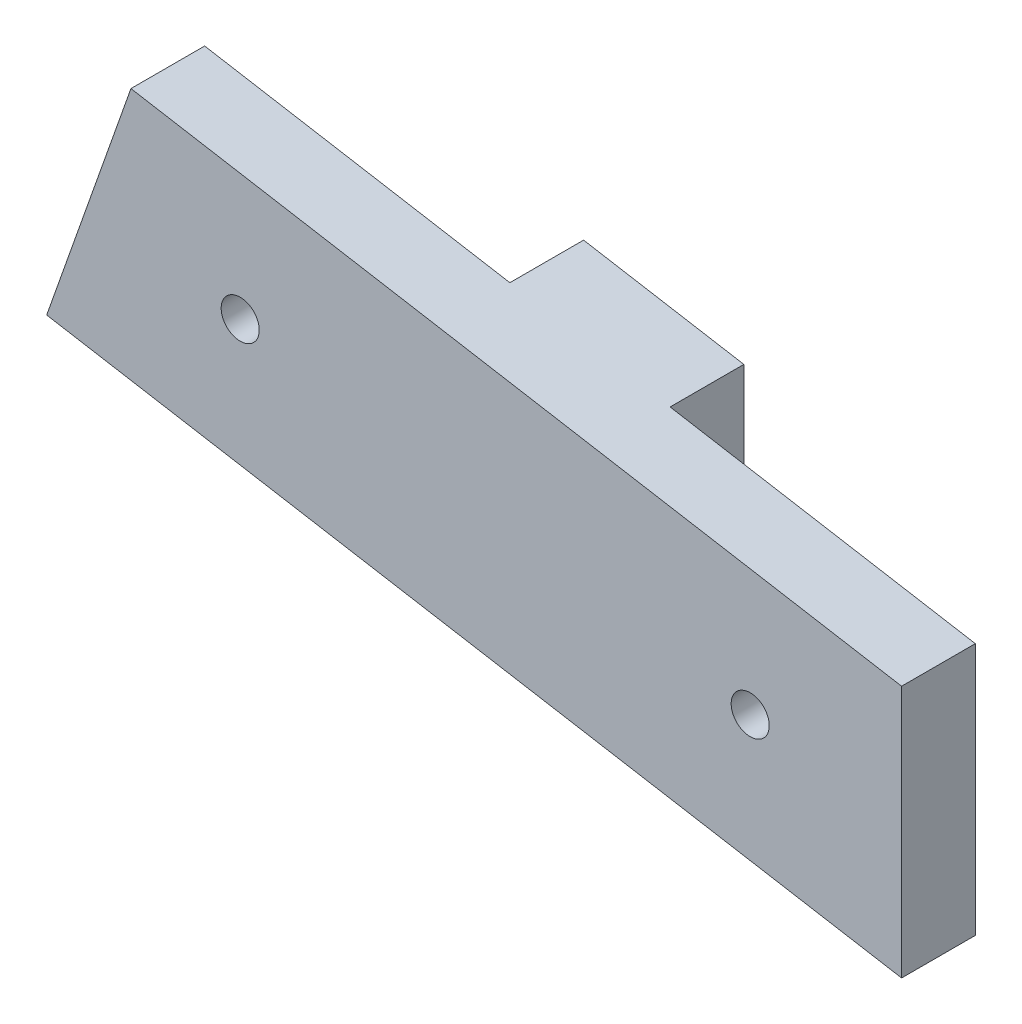
ISO-10303-21;
HEADER;
FILE_DESCRIPTION(('STEP AP214'),'2;1');
FILE_NAME('part.step','',(''),(''),'','','');
FILE_SCHEMA(('AUTOMOTIVE_DESIGN { 1 0 10303 214 1 1 1 1 }'));
ENDSEC;
DATA;
#1=APPLICATION_CONTEXT('core data for automotive mechanical design processes');
#2=APPLICATION_PROTOCOL_DEFINITION('international standard','automotive_design',2000,#1);
#3=PRODUCT_CONTEXT('',#1,'mechanical');
#4=PRODUCT('Part','Part','',(#3));
#5=PRODUCT_RELATED_PRODUCT_CATEGORY('part','',(#4));
#6=PRODUCT_DEFINITION_FORMATION('','',#4);
#7=PRODUCT_DEFINITION_CONTEXT('part definition',#1,'design');
#8=PRODUCT_DEFINITION('design','',#6,#7);
#9=PRODUCT_DEFINITION_SHAPE('','',#8);
#10=(LENGTH_UNIT() NAMED_UNIT(*) SI_UNIT(.MILLI.,.METRE.));
#11=(NAMED_UNIT(*) PLANE_ANGLE_UNIT() SI_UNIT($,.RADIAN.));
#12=(NAMED_UNIT(*) SI_UNIT($,.STERADIAN.) SOLID_ANGLE_UNIT());
#13=UNCERTAINTY_MEASURE_WITH_UNIT(LENGTH_MEASURE(1.E-05),#10,'distance_accuracy_value','');
#14=(GEOMETRIC_REPRESENTATION_CONTEXT(3) GLOBAL_UNCERTAINTY_ASSIGNED_CONTEXT((#13)) GLOBAL_UNIT_ASSIGNED_CONTEXT((#10,
#11,#12)) REPRESENTATION_CONTEXT('',''));
#15=CARTESIAN_POINT('',(0.,0.,0.));
#16=DIRECTION('',(0.,0.,1.));
#17=DIRECTION('',(1.,0.,0.));
#18=AXIS2_PLACEMENT_3D('',#15,#16,#17);
#19=CARTESIAN_POINT('',(0.,0.,0.));
#20=DIRECTION('',(0.,0.,-1.));
#21=DIRECTION('',(-1.,0.,0.));
#22=AXIS2_PLACEMENT_3D('',#19,#20,#21);
#23=PLANE('',#22);
#24=CARTESIAN_POINT('',(-168.147167316458,145.332657633732,0.));
#25=DIRECTION('',(0.,0.,-1.));
#26=DIRECTION('',(-1.,0.,0.));
#27=AXIS2_PLACEMENT_3D('',#24,#25,#26);
#28=CIRCLE('',#27,1.55000000000005);
#29=CARTESIAN_POINT('',(-169.697167316458,145.332657633732,0.));
#30=VERTEX_POINT('',#29);
#31=EDGE_CURVE('E198',#30,#30,#28,.T.);
#32=ORIENTED_EDGE('',*,*,#31,.F.);
#33=EDGE_LOOP('',(#32));
#34=FACE_BOUND('',#33,.T.);
#35=DIRECTION('',(0.333391923739185,0.94278832469727,0.));
#36=VECTOR('',#35,1.);
#37=CARTESIAN_POINT('',(-159.058154615132,133.490679375573,0.));
#38=LINE('',#37,#36);
#39=CARTESIAN_POINT('',(-159.058154615132,133.490679375573,0.));
#40=VERTEX_POINT('',#39);
#41=CARTESIAN_POINT('',(-152.202110077383,152.878667756631,0.));
#42=VERTEX_POINT('',#41);
#43=EDGE_CURVE('E119',#40,#42,#38,.T.);
#44=ORIENTED_EDGE('',*,*,#43,.F.);
#45=DIRECTION('',(0.985593304740158,-0.169132603750356,0.));
#46=VECTOR('',#45,1.);
#47=CARTESIAN_POINT('',(-114.323496857784,125.81399457263,0.));
#48=LINE('',#47,#46);
#49=CARTESIAN_POINT('',(-183.895105894584,137.752820990082,0.));
#50=VERTEX_POINT('',#49);
#51=EDGE_CURVE('E147',#50,#40,#48,.T.);
#52=ORIENTED_EDGE('',*,*,#51,.F.);
#53=DIRECTION('',(-0.333391923739183,-0.942788324697271,0.));
#54=VECTOR('',#53,1.);
#55=CARTESIAN_POINT('',(-183.895105894584,137.752820990082,0.));
#56=LINE('',#55,#54);
#57=CARTESIAN_POINT('',(-177.039061356835,157.140809371141,0.));
#58=VERTEX_POINT('',#57);
#59=EDGE_CURVE('E156',#58,#50,#56,.T.);
#60=ORIENTED_EDGE('',*,*,#59,.F.);
#61=DIRECTION('',(-0.985593304740157,0.16913260375036,0.));
#62=VECTOR('',#61,1.);
#63=CARTESIAN_POINT('',(-177.039061356835,157.140809371141,0.));
#64=LINE('',#63,#62);
#65=EDGE_CURVE('E50',#42,#58,#64,.T.);
#66=ORIENTED_EDGE('',*,*,#65,.F.);
#67=EDGE_LOOP('',(#44,#52,#60,#66));
#68=FACE_BOUND('',#67,.T.);
#69=ADVANCED_FACE('F33',(#34,#68),#23,.T.);
#70=CARTESIAN_POINT('',(-114.323496857784,146.37851353534,6.));
#71=DIRECTION('',(-1.,0.,0.));
#72=DIRECTION('',(0.,-1.,0.));
#73=AXIS2_PLACEMENT_3D('',#70,#71,#72);
#74=PLANE('',#73);
#75=DIRECTION('',(0.,1.,0.));
#76=VECTOR('',#75,1.);
#77=CARTESIAN_POINT('',(-114.323496857784,146.37851353534,0.));
#78=LINE('',#77,#76);
#79=CARTESIAN_POINT('',(-114.323496857784,125.81399457263,0.));
#80=VERTEX_POINT('',#79);
#81=CARTESIAN_POINT('',(-114.323496857784,146.37851353534,0.));
#82=VERTEX_POINT('',#81);
#83=EDGE_CURVE('E123',#80,#82,#78,.T.);
#84=ORIENTED_EDGE('',*,*,#83,.T.);
#85=DIRECTION('',(0.,0.,-1.));
#86=VECTOR('',#85,1.);
#87=CARTESIAN_POINT('',(-114.323496857784,146.37851353534,6.));
#88=LINE('',#87,#86);
#89=CARTESIAN_POINT('',(-114.323496857784,146.37851353534,6.));
#90=VERTEX_POINT('',#89);
#91=EDGE_CURVE('E11',#90,#82,#88,.T.);
#92=ORIENTED_EDGE('',*,*,#91,.F.);
#93=DIRECTION('',(0.,1.,0.));
#94=VECTOR('',#93,1.);
#95=CARTESIAN_POINT('',(-114.323496857784,146.37851353534,6.));
#96=LINE('',#95,#94);
#97=CARTESIAN_POINT('',(-114.323496857784,125.81399457263,6.));
#98=VERTEX_POINT('',#97);
#99=EDGE_CURVE('E143',#98,#90,#96,.T.);
#100=ORIENTED_EDGE('',*,*,#99,.F.);
#101=DIRECTION('',(0.,0.,-1.));
#102=VECTOR('',#101,1.);
#103=CARTESIAN_POINT('',(-114.323496857784,125.81399457263,6.));
#104=LINE('',#103,#102);
#105=EDGE_CURVE('E152',#98,#80,#104,.T.);
#106=ORIENTED_EDGE('',*,*,#105,.T.);
#107=EDGE_LOOP('',(#84,#92,#100,#106));
#108=FACE_BOUND('',#107,.T.);
#109=ADVANCED_FACE('F35',(#108),#74,.F.);
#110=CARTESIAN_POINT('',(-177.039061356835,157.140809371141,6.));
#111=DIRECTION('',(-0.16913260375036,-0.985593304740157,0.));
#112=DIRECTION('',(0.985593304740157,-0.16913260375036,0.));
#113=AXIS2_PLACEMENT_3D('',#110,#111,#112);
#114=PLANE('',#113);
#115=CARTESIAN_POINT('',(-139.160448137236,150.640655149849,0.));
#116=VERTEX_POINT('',#115);
#117=EDGE_CURVE('E122',#82,#116,#64,.T.);
#118=ORIENTED_EDGE('',*,*,#117,.T.);
#119=DIRECTION('',(0.,0.,1.));
#120=VECTOR('',#119,1.);
#121=CARTESIAN_POINT('',(-139.160448137236,150.640655149849,-6.));
#122=LINE('',#121,#120);
#123=CARTESIAN_POINT('',(-139.160448137236,150.640655149849,-6.));
#124=VERTEX_POINT('',#123);
#125=EDGE_CURVE('E104',#124,#116,#122,.T.);
#126=ORIENTED_EDGE('',*,*,#125,.F.);
#127=DIRECTION('',(0.985593304740157,-0.16913260375036,0.));
#128=VECTOR('',#127,1.);
#129=CARTESIAN_POINT('',(-152.202110077383,152.878667756631,-6.));
#130=LINE('',#129,#128);
#131=CARTESIAN_POINT('',(-152.202110077383,152.878667756631,-6.));
#132=VERTEX_POINT('',#131);
#133=EDGE_CURVE('E110',#132,#124,#130,.T.);
#134=ORIENTED_EDGE('',*,*,#133,.F.);
#135=DIRECTION('',(0.,0.,1.));
#136=VECTOR('',#135,1.);
#137=CARTESIAN_POINT('',(-152.202110077383,152.878667756631,-6.));
#138=LINE('',#137,#136);
#139=EDGE_CURVE('E136',#132,#42,#138,.T.);
#140=ORIENTED_EDGE('',*,*,#139,.T.);
#141=ORIENTED_EDGE('',*,*,#65,.T.);
#142=DIRECTION('',(0.,0.,-1.));
#143=VECTOR('',#142,1.);
#144=CARTESIAN_POINT('',(-177.039061356835,157.140809371141,6.));
#145=LINE('',#144,#143);
#146=CARTESIAN_POINT('',(-177.039061356835,157.140809371141,6.));
#147=VERTEX_POINT('',#146);
#148=EDGE_CURVE('E42',#147,#58,#145,.T.);
#149=ORIENTED_EDGE('',*,*,#148,.F.);
#150=DIRECTION('',(-0.985593304740157,0.16913260375036,0.));
#151=VECTOR('',#150,1.);
#152=CARTESIAN_POINT('',(-177.039061356835,157.140809371141,6.));
#153=LINE('',#152,#151);
#154=EDGE_CURVE('E146',#90,#147,#153,.T.);
#155=ORIENTED_EDGE('',*,*,#154,.F.);
#156=ORIENTED_EDGE('',*,*,#91,.T.);
#157=EDGE_LOOP('',(#118,#126,#134,#140,#141,#149,#155,#156));
#158=FACE_BOUND('',#157,.T.);
#159=ADVANCED_FACE('F121',(#158),#114,.F.);
#160=CARTESIAN_POINT('',(-183.895105894584,137.752820990082,6.));
#161=DIRECTION('',(0.942788324697271,-0.333391923739183,0.));
#162=DIRECTION('',(0.333391923739183,0.942788324697271,0.));
#163=AXIS2_PLACEMENT_3D('',#160,#161,#162);
#164=PLANE('',#163);
#165=ORIENTED_EDGE('',*,*,#59,.T.);
#166=DIRECTION('',(0.,0.,-1.));
#167=VECTOR('',#166,1.);
#168=CARTESIAN_POINT('',(-183.895105894584,137.752820990082,6.));
#169=LINE('',#168,#167);
#170=CARTESIAN_POINT('',(-183.895105894584,137.752820990082,6.));
#171=VERTEX_POINT('',#170);
#172=EDGE_CURVE('E170',#171,#50,#169,.T.);
#173=ORIENTED_EDGE('',*,*,#172,.F.);
#174=DIRECTION('',(-0.333391923739183,-0.942788324697271,0.));
#175=VECTOR('',#174,1.);
#176=CARTESIAN_POINT('',(-183.895105894584,137.752820990082,6.));
#177=LINE('',#176,#175);
#178=EDGE_CURVE('E149',#147,#171,#177,.T.);
#179=ORIENTED_EDGE('',*,*,#178,.F.);
#180=ORIENTED_EDGE('',*,*,#148,.T.);
#181=EDGE_LOOP('',(#165,#173,#179,#180));
#182=FACE_BOUND('',#181,.T.);
#183=ADVANCED_FACE('F177',(#182),#164,.F.);
#184=CARTESIAN_POINT('',(-114.323496857784,125.81399457263,6.));
#185=DIRECTION('',(0.169132603750356,0.985593304740158,0.));
#186=DIRECTION('',(-0.985593304740158,0.169132603750356,0.));
#187=AXIS2_PLACEMENT_3D('',#184,#185,#186);
#188=PLANE('',#187);
#189=ORIENTED_EDGE('',*,*,#51,.T.);
#190=DIRECTION('',(0.,0.,1.));
#191=VECTOR('',#190,1.);
#192=CARTESIAN_POINT('',(-159.058154615132,133.490679375573,-6.));
#193=LINE('',#192,#191);
#194=CARTESIAN_POINT('',(-159.058154615132,133.490679375573,-6.));
#195=VERTEX_POINT('',#194);
#196=EDGE_CURVE('E127',#195,#40,#193,.T.);
#197=ORIENTED_EDGE('',*,*,#196,.F.);
#198=DIRECTION('',(-0.985593304740157,0.169132603750361,0.));
#199=VECTOR('',#198,1.);
#200=CARTESIAN_POINT('',(-139.160448137236,130.076136187139,-6.));
#201=LINE('',#200,#199);
#202=CARTESIAN_POINT('',(-139.160448137236,130.076136187139,-6.));
#203=VERTEX_POINT('',#202);
#204=EDGE_CURVE('E109',#203,#195,#201,.T.);
#205=ORIENTED_EDGE('',*,*,#204,.F.);
#206=DIRECTION('',(0.,0.,1.));
#207=VECTOR('',#206,1.);
#208=CARTESIAN_POINT('',(-139.160448137236,130.076136187139,-6.));
#209=LINE('',#208,#207);
#210=CARTESIAN_POINT('',(-139.160448137236,130.076136187139,0.));
#211=VERTEX_POINT('',#210);
#212=EDGE_CURVE('E106',#203,#211,#209,.T.);
#213=ORIENTED_EDGE('',*,*,#212,.T.);
#214=EDGE_CURVE('E163',#211,#80,#48,.T.);
#215=ORIENTED_EDGE('',*,*,#214,.T.);
#216=ORIENTED_EDGE('',*,*,#105,.F.);
#217=DIRECTION('',(0.985593304740158,-0.169132603750356,0.));
#218=VECTOR('',#217,1.);
#219=CARTESIAN_POINT('',(-114.323496857784,125.81399457263,6.));
#220=LINE('',#219,#218);
#221=EDGE_CURVE('E151',#171,#98,#220,.T.);
#222=ORIENTED_EDGE('',*,*,#221,.F.);
#223=ORIENTED_EDGE('',*,*,#172,.T.);
#224=EDGE_LOOP('',(#189,#197,#205,#213,#215,#216,#222,#223));
#225=FACE_BOUND('',#224,.T.);
#226=ADVANCED_FACE('F184',(#225),#188,.F.);
#227=CARTESIAN_POINT('',(0.,0.,6.));
#228=DIRECTION('',(0.,0.,-1.));
#229=DIRECTION('',(-1.,0.,0.));
#230=AXIS2_PLACEMENT_3D('',#227,#228,#229);
#231=PLANE('',#230);
#232=CARTESIAN_POINT('',(-168.147167316458,145.332657633732,6.));
#233=DIRECTION('',(0.,0.,-1.));
#234=DIRECTION('',(-1.,0.,0.));
#235=AXIS2_PLACEMENT_3D('',#232,#233,#234);
#236=CIRCLE('',#235,1.55000000000005);
#237=CARTESIAN_POINT('',(-169.697167316458,145.332657633732,6.));
#238=VERTEX_POINT('',#237);
#239=EDGE_CURVE('E195',#238,#238,#236,.T.);
#240=ORIENTED_EDGE('',*,*,#239,.T.);
#241=EDGE_LOOP('',(#240));
#242=FACE_BOUND('',#241,.T.);
#243=CARTESIAN_POINT('',(-126.643413167036,138.210411600864,6.));
#244=DIRECTION('',(0.,0.,-1.));
#245=DIRECTION('',(-1.,0.,0.));
#246=AXIS2_PLACEMENT_3D('',#243,#244,#245);
#247=CIRCLE('',#246,1.55000000000003);
#248=CARTESIAN_POINT('',(-128.193413167036,138.210411600864,6.));
#249=VERTEX_POINT('',#248);
#250=EDGE_CURVE('E194',#249,#249,#247,.T.);
#251=ORIENTED_EDGE('',*,*,#250,.T.);
#252=EDGE_LOOP('',(#251));
#253=FACE_BOUND('',#252,.T.);
#254=ORIENTED_EDGE('',*,*,#99,.T.);
#255=ORIENTED_EDGE('',*,*,#154,.T.);
#256=ORIENTED_EDGE('',*,*,#178,.T.);
#257=ORIENTED_EDGE('',*,*,#221,.T.);
#258=EDGE_LOOP('',(#254,#255,#256,#257));
#259=FACE_BOUND('',#258,.T.);
#260=ADVANCED_FACE('F204',(#242,#253,#259),#231,.F.);
#261=CARTESIAN_POINT('',(-126.643413167036,138.210411600864,0.));
#262=DIRECTION('',(0.,0.,-1.));
#263=DIRECTION('',(-1.,0.,0.));
#264=AXIS2_PLACEMENT_3D('',#261,#262,#263);
#265=CIRCLE('',#264,1.55000000000003);
#266=CARTESIAN_POINT('',(-128.193413167036,138.210411600864,0.));
#267=VERTEX_POINT('',#266);
#268=EDGE_CURVE('E191',#267,#267,#265,.T.);
#269=ORIENTED_EDGE('',*,*,#268,.F.);
#270=EDGE_LOOP('',(#269));
#271=FACE_BOUND('',#270,.T.);
#272=DIRECTION('',(0.,-1.,0.));
#273=VECTOR('',#272,1.);
#274=CARTESIAN_POINT('',(-139.160448137236,150.640655149849,0.));
#275=LINE('',#274,#273);
#276=EDGE_CURVE('E58',#116,#211,#275,.T.);
#277=ORIENTED_EDGE('',*,*,#276,.F.);
#278=ORIENTED_EDGE('',*,*,#117,.F.);
#279=ORIENTED_EDGE('',*,*,#83,.F.);
#280=ORIENTED_EDGE('',*,*,#214,.F.);
#281=EDGE_LOOP('',(#277,#278,#279,#280));
#282=FACE_BOUND('',#281,.T.);
#283=ADVANCED_FACE('F216',(#271,#282),#23,.T.);
#284=CARTESIAN_POINT('',(-139.160448137236,150.640655149849,-6.));
#285=DIRECTION('',(-1.,0.,0.));
#286=DIRECTION('',(0.,-1.,0.));
#287=AXIS2_PLACEMENT_3D('',#284,#285,#286);
#288=PLANE('',#287);
#289=ORIENTED_EDGE('',*,*,#276,.T.);
#290=ORIENTED_EDGE('',*,*,#212,.F.);
#291=DIRECTION('',(0.,-1.,0.));
#292=VECTOR('',#291,1.);
#293=CARTESIAN_POINT('',(-139.160448137236,150.640655149849,-6.));
#294=LINE('',#293,#292);
#295=EDGE_CURVE('E100',#124,#203,#294,.T.);
#296=ORIENTED_EDGE('',*,*,#295,.F.);
#297=ORIENTED_EDGE('',*,*,#125,.T.);
#298=EDGE_LOOP('',(#289,#290,#296,#297));
#299=FACE_BOUND('',#298,.T.);
#300=ADVANCED_FACE('F102',(#299),#288,.F.);
#301=CARTESIAN_POINT('',(-159.058154615132,133.490679375573,-6.));
#302=DIRECTION('',(0.94278832469727,-0.333391923739185,0.));
#303=DIRECTION('',(0.333391923739185,0.94278832469727,0.));
#304=AXIS2_PLACEMENT_3D('',#301,#302,#303);
#305=PLANE('',#304);
#306=ORIENTED_EDGE('',*,*,#43,.T.);
#307=ORIENTED_EDGE('',*,*,#139,.F.);
#308=DIRECTION('',(0.333391923739185,0.94278832469727,0.));
#309=VECTOR('',#308,1.);
#310=CARTESIAN_POINT('',(-159.058154615132,133.490679375573,-6.));
#311=LINE('',#310,#309);
#312=EDGE_CURVE('E115',#195,#132,#311,.T.);
#313=ORIENTED_EDGE('',*,*,#312,.F.);
#314=ORIENTED_EDGE('',*,*,#196,.T.);
#315=EDGE_LOOP('',(#306,#307,#313,#314));
#316=FACE_BOUND('',#315,.T.);
#317=ADVANCED_FACE('F187',(#316),#305,.F.);
#318=CARTESIAN_POINT('',(0.,0.,-6.));
#319=DIRECTION('',(0.,0.,-1.));
#320=DIRECTION('',(-1.,0.,0.));
#321=AXIS2_PLACEMENT_3D('',#318,#319,#320);
#322=PLANE('',#321);
#323=ORIENTED_EDGE('',*,*,#133,.T.);
#324=ORIENTED_EDGE('',*,*,#295,.T.);
#325=ORIENTED_EDGE('',*,*,#204,.T.);
#326=ORIENTED_EDGE('',*,*,#312,.T.);
#327=EDGE_LOOP('',(#323,#324,#325,#326));
#328=FACE_BOUND('',#327,.T.);
#329=ADVANCED_FACE('F113',(#328),#322,.T.);
#330=CARTESIAN_POINT('',(-126.643413167036,138.210411600864,6.));
#331=DIRECTION('',(0.,0.,-1.));
#332=DIRECTION('',(-1.,0.,0.));
#333=AXIS2_PLACEMENT_3D('',#330,#331,#332);
#334=CYLINDRICAL_SURFACE('',#333,1.55000000000003);
#335=ORIENTED_EDGE('',*,*,#250,.F.);
#336=EDGE_LOOP('',(#335));
#337=FACE_BOUND('',#336,.T.);
#338=ORIENTED_EDGE('',*,*,#268,.T.);
#339=EDGE_LOOP('',(#338));
#340=FACE_BOUND('',#339,.T.);
#341=ADVANCED_FACE('F210',(#337,#340),#334,.F.);
#342=CARTESIAN_POINT('',(-168.147167316458,145.332657633732,6.));
#343=DIRECTION('',(0.,0.,-1.));
#344=DIRECTION('',(-1.,0.,0.));
#345=AXIS2_PLACEMENT_3D('',#342,#343,#344);
#346=CYLINDRICAL_SURFACE('',#345,1.55000000000005);
#347=ORIENTED_EDGE('',*,*,#239,.F.);
#348=EDGE_LOOP('',(#347));
#349=FACE_BOUND('',#348,.T.);
#350=ORIENTED_EDGE('',*,*,#31,.T.);
#351=EDGE_LOOP('',(#350));
#352=FACE_BOUND('',#351,.T.);
#353=ADVANCED_FACE('F207',(#349,#352),#346,.F.);
#354=CLOSED_SHELL('',(#69,#109,#159,#183,#226,#260,#283,#300,#317,#329,#341,#353));
#355=MANIFOLD_SOLID_BREP('B2',#354);
#356=ADVANCED_BREP_SHAPE_REPRESENTATION('',(#18,#355),#14);
#357=SHAPE_DEFINITION_REPRESENTATION(#9,#356);
ENDSEC;
END-ISO-10303-21;
